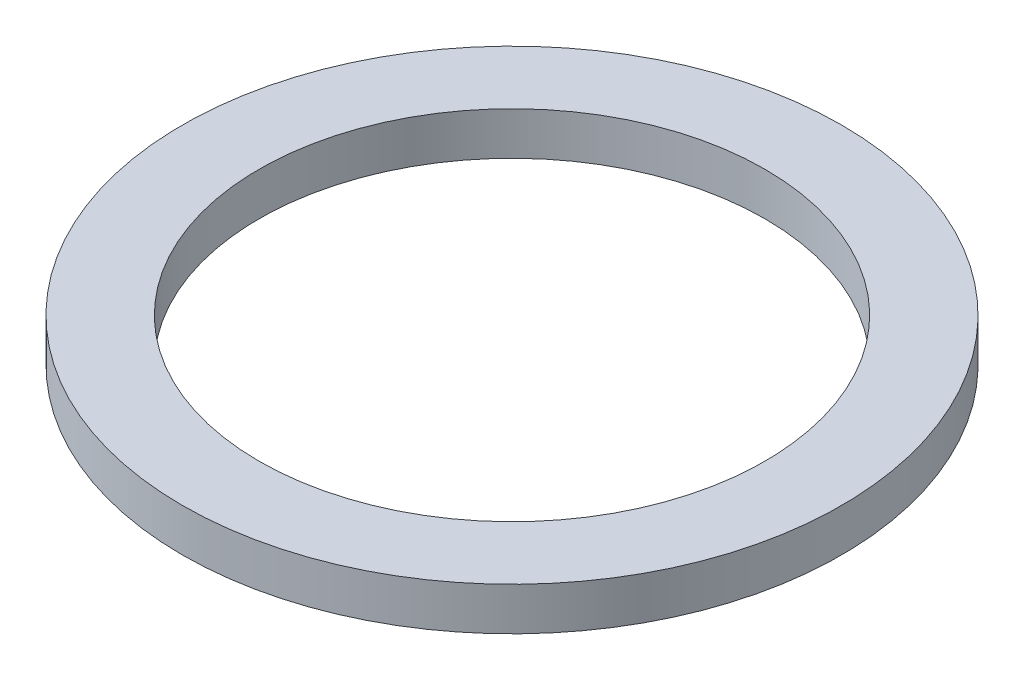
ISO-10303-21;
HEADER;
FILE_DESCRIPTION(('STEP AP214'),'2;1');
FILE_NAME('part.step','',(''),(''),'','','');
FILE_SCHEMA(('AUTOMOTIVE_DESIGN { 1 0 10303 214 1 1 1 1 }'));
ENDSEC;
DATA;
#1=APPLICATION_CONTEXT('core data for automotive mechanical design processes');
#2=APPLICATION_PROTOCOL_DEFINITION('international standard','automotive_design',2000,#1);
#3=PRODUCT_CONTEXT('',#1,'mechanical');
#4=PRODUCT('Part','Part','',(#3));
#5=PRODUCT_RELATED_PRODUCT_CATEGORY('part','',(#4));
#6=PRODUCT_DEFINITION_FORMATION('','',#4);
#7=PRODUCT_DEFINITION_CONTEXT('part definition',#1,'design');
#8=PRODUCT_DEFINITION('design','',#6,#7);
#9=PRODUCT_DEFINITION_SHAPE('','',#8);
#10=(LENGTH_UNIT() NAMED_UNIT(*) SI_UNIT(.MILLI.,.METRE.));
#11=(NAMED_UNIT(*) PLANE_ANGLE_UNIT() SI_UNIT($,.RADIAN.));
#12=(NAMED_UNIT(*) SI_UNIT($,.STERADIAN.) SOLID_ANGLE_UNIT());
#13=UNCERTAINTY_MEASURE_WITH_UNIT(LENGTH_MEASURE(1.E-05),#10,'distance_accuracy_value','');
#14=(GEOMETRIC_REPRESENTATION_CONTEXT(3) GLOBAL_UNCERTAINTY_ASSIGNED_CONTEXT((#13)) GLOBAL_UNIT_ASSIGNED_CONTEXT((#10,
#11,#12)) REPRESENTATION_CONTEXT('',''));
#15=CARTESIAN_POINT('',(0.,0.,0.));
#16=DIRECTION('',(0.,0.,1.));
#17=DIRECTION('',(1.,0.,0.));
#18=AXIS2_PLACEMENT_3D('',#15,#16,#17);
#19=CARTESIAN_POINT('',(0.,2.8,0.));
#20=DIRECTION('',(0.,-1.,0.));
#21=DIRECTION('',(0.,0.,-1.));
#22=AXIS2_PLACEMENT_3D('',#19,#20,#21);
#23=CYLINDRICAL_SURFACE('',#22,16.5);
#24=CARTESIAN_POINT('',(0.,2.8,0.));
#25=DIRECTION('',(0.,1.,0.));
#26=DIRECTION('',(0.,0.,1.));
#27=AXIS2_PLACEMENT_3D('',#24,#25,#26);
#28=CIRCLE('',#27,16.5);
#29=CARTESIAN_POINT('',(0.,2.8,16.5));
#30=VERTEX_POINT('',#29);
#31=EDGE_CURVE('E38',#30,#30,#28,.T.);
#32=ORIENTED_EDGE('',*,*,#31,.T.);
#33=EDGE_LOOP('',(#32));
#34=FACE_BOUND('',#33,.T.);
#35=CARTESIAN_POINT('',(0.,0.,0.));
#36=DIRECTION('',(0.,1.,0.));
#37=DIRECTION('',(0.,0.,1.));
#38=AXIS2_PLACEMENT_3D('',#35,#36,#37);
#39=CIRCLE('',#38,16.5);
#40=CARTESIAN_POINT('',(0.,0.,16.5));
#41=VERTEX_POINT('',#40);
#42=EDGE_CURVE('E44',#41,#41,#39,.T.);
#43=ORIENTED_EDGE('',*,*,#42,.F.);
#44=EDGE_LOOP('',(#43));
#45=FACE_BOUND('',#44,.T.);
#46=ADVANCED_FACE('F31',(#34,#45),#23,.F.);
#47=CARTESIAN_POINT('',(0.,2.8,0.));
#48=DIRECTION('',(0.,-1.,0.));
#49=DIRECTION('',(0.,0.,-1.));
#50=AXIS2_PLACEMENT_3D('',#47,#48,#49);
#51=CYLINDRICAL_SURFACE('',#50,21.5);
#52=CARTESIAN_POINT('',(0.,2.8,0.));
#53=DIRECTION('',(0.,1.,0.));
#54=DIRECTION('',(0.,0.,1.));
#55=AXIS2_PLACEMENT_3D('',#52,#53,#54);
#56=CIRCLE('',#55,21.5);
#57=CARTESIAN_POINT('',(0.,2.8,21.5));
#58=VERTEX_POINT('',#57);
#59=EDGE_CURVE('E10',#58,#58,#56,.T.);
#60=ORIENTED_EDGE('',*,*,#59,.F.);
#61=EDGE_LOOP('',(#60));
#62=FACE_BOUND('',#61,.T.);
#63=CARTESIAN_POINT('',(0.,0.,0.));
#64=DIRECTION('',(0.,1.,0.));
#65=DIRECTION('',(0.,0.,1.));
#66=AXIS2_PLACEMENT_3D('',#63,#64,#65);
#67=CIRCLE('',#66,21.5);
#68=CARTESIAN_POINT('',(0.,0.,21.5));
#69=VERTEX_POINT('',#68);
#70=EDGE_CURVE('E34',#69,#69,#67,.T.);
#71=ORIENTED_EDGE('',*,*,#70,.T.);
#72=EDGE_LOOP('',(#71));
#73=FACE_BOUND('',#72,.T.);
#74=ADVANCED_FACE('F51',(#62,#73),#51,.T.);
#75=CARTESIAN_POINT('',(0.,2.8,0.));
#76=DIRECTION('',(0.,1.,0.));
#77=DIRECTION('',(0.,0.,1.));
#78=AXIS2_PLACEMENT_3D('',#75,#76,#77);
#79=PLANE('',#78);
#80=ORIENTED_EDGE('',*,*,#31,.F.);
#81=EDGE_LOOP('',(#80));
#82=FACE_BOUND('',#81,.T.);
#83=ORIENTED_EDGE('',*,*,#59,.T.);
#84=EDGE_LOOP('',(#83));
#85=FACE_BOUND('',#84,.T.);
#86=ADVANCED_FACE('F55',(#82,#85),#79,.T.);
#87=CARTESIAN_POINT('',(0.,0.,0.));
#88=DIRECTION('',(0.,1.,0.));
#89=DIRECTION('',(0.,0.,1.));
#90=AXIS2_PLACEMENT_3D('',#87,#88,#89);
#91=PLANE('',#90);
#92=ORIENTED_EDGE('',*,*,#42,.T.);
#93=EDGE_LOOP('',(#92));
#94=FACE_BOUND('',#93,.T.);
#95=ORIENTED_EDGE('',*,*,#70,.F.);
#96=EDGE_LOOP('',(#95));
#97=FACE_BOUND('',#96,.T.);
#98=ADVANCED_FACE('F53',(#94,#97),#91,.F.);
#99=CLOSED_SHELL('',(#46,#74,#86,#98));
#100=MANIFOLD_SOLID_BREP('B2',#99);
#101=ADVANCED_BREP_SHAPE_REPRESENTATION('',(#18,#100),#14);
#102=SHAPE_DEFINITION_REPRESENTATION(#9,#101);
ENDSEC;
END-ISO-10303-21;
